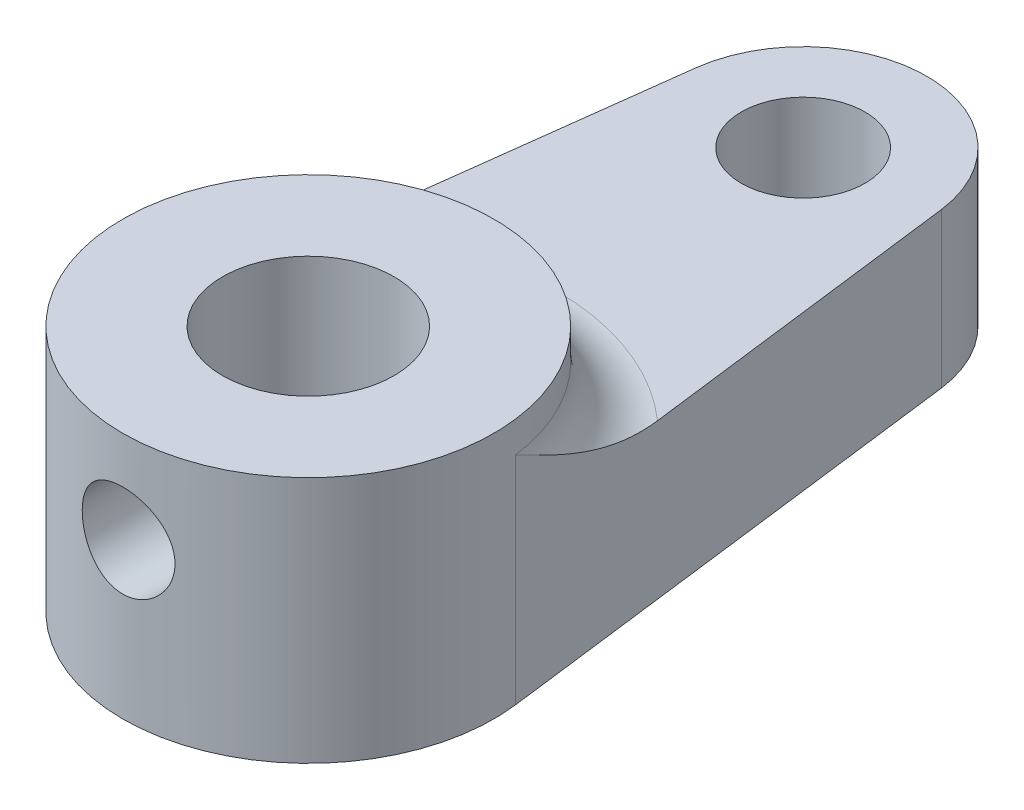
ISO-10303-21;
HEADER;
FILE_DESCRIPTION(('STEP AP214'),'2;1');
FILE_NAME('part.step','',(''),(''),'','','');
FILE_SCHEMA(('AUTOMOTIVE_DESIGN { 1 0 10303 214 1 1 1 1 }'));
ENDSEC;
DATA;
#1=APPLICATION_CONTEXT('core data for automotive mechanical design processes');
#2=APPLICATION_PROTOCOL_DEFINITION('international standard','automotive_design',2000,#1);
#3=PRODUCT_CONTEXT('',#1,'mechanical');
#4=PRODUCT('Part','Part','',(#3));
#5=PRODUCT_RELATED_PRODUCT_CATEGORY('part','',(#4));
#6=PRODUCT_DEFINITION_FORMATION('','',#4);
#7=PRODUCT_DEFINITION_CONTEXT('part definition',#1,'design');
#8=PRODUCT_DEFINITION('design','',#6,#7);
#9=PRODUCT_DEFINITION_SHAPE('','',#8);
#10=(LENGTH_UNIT() NAMED_UNIT(*) SI_UNIT(.MILLI.,.METRE.));
#11=(NAMED_UNIT(*) PLANE_ANGLE_UNIT() SI_UNIT($,.RADIAN.));
#12=(NAMED_UNIT(*) SI_UNIT($,.STERADIAN.) SOLID_ANGLE_UNIT());
#13=UNCERTAINTY_MEASURE_WITH_UNIT(LENGTH_MEASURE(1.E-05),#10,'distance_accuracy_value','');
#14=(GEOMETRIC_REPRESENTATION_CONTEXT(3) GLOBAL_UNCERTAINTY_ASSIGNED_CONTEXT((#13)) GLOBAL_UNIT_ASSIGNED_CONTEXT((#10,
#11,#12)) REPRESENTATION_CONTEXT('',''));
#15=CARTESIAN_POINT('',(0.,0.,0.));
#16=DIRECTION('',(0.,0.,1.));
#17=DIRECTION('',(1.,0.,0.));
#18=AXIS2_PLACEMENT_3D('',#15,#16,#17);
#19=CARTESIAN_POINT('',(0.,2.5,0.));
#20=DIRECTION('',(0.,-1.,0.));
#21=DIRECTION('',(0.,0.,-1.));
#22=AXIS2_PLACEMENT_3D('',#19,#20,#21);
#23=CYLINDRICAL_SURFACE('',#22,6.);
#24=CARTESIAN_POINT('',(0.,4.5,0.));
#25=DIRECTION('',(0.,1.,0.));
#26=DIRECTION('',(0.,0.,1.));
#27=AXIS2_PLACEMENT_3D('',#24,#25,#26);
#28=CIRCLE('',#27,6.);
#29=CARTESIAN_POINT('',(5.95294044989533,4.5,-0.75));
#30=VERTEX_POINT('',#29);
#31=CARTESIAN_POINT('',(-5.95294044989533,4.5,-0.75));
#32=VERTEX_POINT('',#31);
#33=EDGE_CURVE('E125',#30,#32,#28,.T.);
#34=ORIENTED_EDGE('',*,*,#33,.T.);
#35=DIRECTION('',(0.,-1.,0.));
#36=VECTOR('',#35,1.);
#37=CARTESIAN_POINT('',(-5.95294044989533,2.5,-0.75));
#38=LINE('',#37,#36);
#39=CARTESIAN_POINT('',(-5.95294044989533,-2.5,-0.75));
#40=VERTEX_POINT('',#39);
#41=EDGE_CURVE('E109',#32,#40,#38,.T.);
#42=ORIENTED_EDGE('',*,*,#41,.T.);
#43=CARTESIAN_POINT('',(0.,-2.5,0.));
#44=DIRECTION('',(0.,1.,0.));
#45=DIRECTION('',(0.,0.,1.));
#46=AXIS2_PLACEMENT_3D('',#43,#44,#45);
#47=CIRCLE('',#46,6.);
#48=CARTESIAN_POINT('',(5.95294044989533,-2.5,-0.75));
#49=VERTEX_POINT('',#48);
#50=EDGE_CURVE('E113',#40,#49,#47,.T.);
#51=ORIENTED_EDGE('',*,*,#50,.T.);
#52=DIRECTION('',(0.,-1.,0.));
#53=VECTOR('',#52,1.);
#54=CARTESIAN_POINT('',(5.95294044989533,2.5,-0.75));
#55=LINE('',#54,#53);
#56=EDGE_CURVE('E102',#30,#49,#55,.T.);
#57=ORIENTED_EDGE('',*,*,#56,.F.);
#58=EDGE_LOOP('',(#34,#42,#51,#57));
#59=FACE_BOUND('',#58,.T.);
#60=CARTESIAN_POINT('',(0.,5.5,0.));
#61=DIRECTION('',(0.,1.,0.));
#62=DIRECTION('',(0.,0.,1.));
#63=AXIS2_PLACEMENT_3D('',#60,#61,#62);
#64=CIRCLE('',#63,6.);
#65=CARTESIAN_POINT('',(0.,5.5,6.));
#66=VERTEX_POINT('',#65);
#67=EDGE_CURVE('E196',#66,#66,#64,.T.);
#68=ORIENTED_EDGE('',*,*,#67,.F.);
#69=EDGE_LOOP('',(#68));
#70=FACE_BOUND('',#69,.T.);
#71=CARTESIAN_POINT('',(-1.5,2.5,5.80947501931112));
#72=CARTESIAN_POINT('',(-1.49999764715507,2.41716954944523,5.80947660051185));
#73=CARTESIAN_POINT('',(-1.49311574729838,2.3343130607932,5.81126583608348));
#74=CARTESIAN_POINT('',(-1.46581387527848,2.17097945309558,5.81821117195949));
#75=CARTESIAN_POINT('',(-1.44538602404532,2.090503747319,5.82336923173088));
#76=CARTESIAN_POINT('',(-1.39169471977917,1.93431787708777,5.8364323475758));
#77=CARTESIAN_POINT('',(-1.35844783671268,1.8586017067686,5.84433385614245));
#78=CARTESIAN_POINT('',(-1.28011268475685,1.71381348847605,5.86198915217285));
#79=CARTESIAN_POINT('',(-1.23502391313642,1.64474172275186,5.87174301827101));
#80=CARTESIAN_POINT('',(-1.13322505638712,1.51368301284268,5.89224429813367));
#81=CARTESIAN_POINT('',(-1.07630213262243,1.45186383978997,5.90300758573818));
#82=CARTESIAN_POINT('',(-0.952909238460399,1.33854316338379,5.92417725309178));
#83=CARTESIAN_POINT('',(-0.886438376508184,1.28704262462695,5.93458359939833));
#84=CARTESIAN_POINT('',(-0.744687120647373,1.19513471942123,5.95404249312349));
#85=CARTESIAN_POINT('',(-0.669296745717072,1.15489216710312,5.96307412440355));
#86=CARTESIAN_POINT('',(-0.512557910575657,1.08771421350815,5.9785848715559));
#87=CARTESIAN_POINT('',(-0.431210331475164,1.06077684885069,5.98506436400606));
#88=CARTESIAN_POINT('',(-0.266615255252497,1.02151129925285,5.99462855308908));
#89=CARTESIAN_POINT('',(-0.183439631729385,1.00889821340405,5.99777936306588));
#90=CARTESIAN_POINT('',(-0.0160972915576614,0.997744972434667,6.00056156464378));
#91=CARTESIAN_POINT('',(0.0680692767228413,0.99920273667424,6.00019347658022));
#92=CARTESIAN_POINT('',(0.233028370758581,1.01594491015009,5.9960285697212));
#93=CARTESIAN_POINT('',(0.313854323401601,1.03092179503231,5.99230801404524));
#94=CARTESIAN_POINT('',(0.47180737112053,1.0737827620291,5.98194501914912));
#95=CARTESIAN_POINT('',(0.548934269055657,1.10166753122645,5.97530242439064));
#96=CARTESIAN_POINT('',(0.69811005525271,1.16980154241224,5.95972505820537));
#97=CARTESIAN_POINT('',(0.770106764649757,1.21016022679705,5.95077011817032));
#98=CARTESIAN_POINT('',(0.906413433510733,1.30201340746975,5.93153942285789));
#99=CARTESIAN_POINT('',(0.970722052628258,1.35350984113637,5.92126343791494));
#100=CARTESIAN_POINT('',(1.09166105262743,1.46782524518943,5.90018228261712));
#101=CARTESIAN_POINT('',(1.1480365186128,1.53091293540866,5.8893703171555));
#102=CARTESIAN_POINT('',(1.24946456394453,1.66575998412415,5.86869026110024));
#103=CARTESIAN_POINT('',(1.29451661406902,1.7375197476946,5.85882221463582));
#104=CARTESIAN_POINT('',(1.3721821935339,1.88817402048938,5.84112298098989));
#105=CARTESIAN_POINT('',(1.40473435045574,1.96710143818792,5.83330190235432));
#106=CARTESIAN_POINT('',(1.45602843095451,2.12955128084587,5.82071184083974));
#107=CARTESIAN_POINT('',(1.47477330982936,2.21307271838988,5.81594220486131));
#108=CARTESIAN_POINT('',(1.49749778319911,2.37997570091387,5.81013213623484));
#109=CARTESIAN_POINT('',(1.50185428435178,2.46330267599778,5.80899653456189));
#110=CARTESIAN_POINT('',(1.49671019430933,2.6294931619469,5.81032406088623));
#111=CARTESIAN_POINT('',(1.48721087870928,2.71235671477074,5.81278685760759));
#112=CARTESIAN_POINT('',(1.4549552783626,2.87386855897282,5.82094249172736));
#113=CARTESIAN_POINT('',(1.43241844096905,2.95256363594251,5.82658182140625));
#114=CARTESIAN_POINT('',(1.37497084900237,3.10505887471101,5.84040430962577));
#115=CARTESIAN_POINT('',(1.34005862862753,3.1788584554332,5.84858776949168));
#116=CARTESIAN_POINT('',(1.25806240076193,3.32106476672041,5.86677682255957));
#117=CARTESIAN_POINT('',(1.21075305230138,3.38933730402586,5.87681501163985));
#118=CARTESIAN_POINT('',(1.10559043940168,3.51711301768081,5.89750249843029));
#119=CARTESIAN_POINT('',(1.04773544220816,3.57661474999004,5.90815189637082));
#120=CARTESIAN_POINT('',(0.921394081477088,3.68668662554257,5.92918441818964));
#121=CARTESIAN_POINT('',(0.852677928797388,3.73699603752929,5.93955421237101));
#122=CARTESIAN_POINT('',(0.707554024042012,3.82536152017075,5.9585832996824));
#123=CARTESIAN_POINT('',(0.631146673436386,3.86341822996492,5.96724268202376));
#124=CARTESIAN_POINT('',(0.473337302596635,3.92586762071676,5.98182069442988));
#125=CARTESIAN_POINT('',(0.391976071541821,3.95035857062744,5.98775898013446));
#126=CARTESIAN_POINT('',(0.226124640478211,3.98527620076505,5.99631176037473));
#127=CARTESIAN_POINT('',(0.141635047561865,3.99570559524343,5.99892689636045));
#128=CARTESIAN_POINT('',(-0.0256252896649894,4.0020513843633,6.00051254113216));
#129=CARTESIAN_POINT('',(-0.10838074044905,3.99835256364309,5.99957968320012));
#130=CARTESIAN_POINT('',(-0.272051244622109,3.9774282590585,5.99438844686135));
#131=CARTESIAN_POINT('',(-0.35296635267133,3.96020317748035,5.99013016735642));
#132=CARTESIAN_POINT('',(-0.510256553467224,3.91292167034361,5.97878149280944));
#133=CARTESIAN_POINT('',(-0.586653741871528,3.88293482002806,5.97170646753999));
#134=CARTESIAN_POINT('',(-0.733375579562203,3.81104413147101,5.95546933370076));
#135=CARTESIAN_POINT('',(-0.803699461897577,3.76913879099565,5.94630696206604));
#136=CARTESIAN_POINT('',(-0.938102892635849,3.67342714900439,5.92660874521999));
#137=CARTESIAN_POINT('',(-1.00199248245088,3.61935978563893,5.91604525418417));
#138=CARTESIAN_POINT('',(-1.11992253040688,3.5013657220393,5.89485973579863));
#139=CARTESIAN_POINT('',(-1.17396048760228,3.43743652585314,5.88423769428833));
#140=CARTESIAN_POINT('',(-1.27164303971884,3.300097878698,5.86391213790822));
#141=CARTESIAN_POINT('',(-1.31507492916982,3.22653381488106,5.85422945594827));
#142=CARTESIAN_POINT('',(-1.3888903449235,3.07291676511595,5.83715933325923));
#143=CARTESIAN_POINT('',(-1.41928336463958,2.99286855083989,5.82977022370054));
#144=CARTESIAN_POINT('',(-1.46163379284816,2.84413448225993,5.81927863109675));
#145=CARTESIAN_POINT('',(-1.47598975589307,2.77616025342421,5.8156299450082));
#146=CARTESIAN_POINT('',(-1.4951734388599,2.63879669650005,5.81072757878358));
#147=CARTESIAN_POINT('',(-1.50000197155828,2.56940748963241,5.80947369434944));
#148=CARTESIAN_POINT('',(-1.5,2.5,5.80947501931112));
#149=B_SPLINE_CURVE_WITH_KNOTS('',3,(#71,#72,#73,#74,#75,#76,#77,#78,#79,#80,#81,#82,#83,#84,
#85,#86,#87,#88,#89,#90,#91,#92,#93,#94,#95,#96,#97,#98,#99,#100,#101,#102,#103,#104,#105,#106,
#107,#108,#109,#110,#111,#112,#113,#114,#115,#116,#117,#118,#119,#120,#121,#122,#123,#124,#125,
#126,#127,#128,#129,#130,#131,#132,#133,#134,#135,#136,#137,#138,#139,#140,#141,#142,#143,#144,
#145,#146,#147,#148),.UNSPECIFIED.,.T.,.F.,(4,2,2,2,2,2,2,2,2,2,2,2,2,2,2,2,2,2,2,2,2,2,2,2,2,2,
2,2,2,2,2,2,2,2,2,2,2,2,4),(0.,0.248236465041682,0.4966174448572,0.744678436299613,
0.992749960532872,1.24574372515786,1.4987611288792,1.75530897838752,2.01181895908255,
2.26313250597208,2.51440889199612,2.76010957613368,3.00582334034872,3.25375724552667,
3.50173431281348,3.75642279943147,4.01112318719881,4.26705859205041,4.52293920077729,
4.7720614485703,5.02116076310281,5.26618443005524,5.51123712852851,5.76109707515494,
6.01099811331027,6.26715198579191,6.52329249431732,6.77755243684158,7.03176329345423,
7.27910067676474,7.52643070426189,7.77242925935827,8.01845883442843,8.27038257949243,
8.52237018939305,8.77905886370806,9.03556032819972,9.24358696306398,9.45159585059713),.UNSPECIFIED.);
#150=CARTESIAN_POINT('',(-1.5,2.5,5.80947501931112));
#151=VERTEX_POINT('',#150);
#152=EDGE_CURVE('E155',#151,#151,#149,.T.);
#153=ORIENTED_EDGE('',*,*,#152,.F.);
#154=EDGE_LOOP('',(#153));
#155=FACE_BOUND('',#154,.T.);
#156=ADVANCED_FACE('F33',(#59,#70,#155),#23,.T.);
#157=CARTESIAN_POINT('',(0.,2.5,0.));
#158=DIRECTION('',(0.,-1.,0.));
#159=DIRECTION('',(0.,0.,-1.));
#160=AXIS2_PLACEMENT_3D('',#157,#158,#159);
#161=CYLINDRICAL_SURFACE('',#160,2.77361799511822);
#162=CARTESIAN_POINT('',(0.,5.5,0.));
#163=DIRECTION('',(0.,1.,0.));
#164=DIRECTION('',(0.,0.,1.));
#165=AXIS2_PLACEMENT_3D('',#162,#163,#164);
#166=CIRCLE('',#165,2.77361799511822);
#167=CARTESIAN_POINT('',(0.,5.5,2.77361799511822));
#168=VERTEX_POINT('',#167);
#169=EDGE_CURVE('E161',#168,#168,#166,.T.);
#170=ORIENTED_EDGE('',*,*,#169,.T.);
#171=EDGE_LOOP('',(#170));
#172=FACE_BOUND('',#171,.T.);
#173=CARTESIAN_POINT('',(0.,-2.5,0.));
#174=DIRECTION('',(0.,1.,0.));
#175=DIRECTION('',(0.,0.,1.));
#176=AXIS2_PLACEMENT_3D('',#173,#174,#175);
#177=CIRCLE('',#176,2.77361799511822);
#178=CARTESIAN_POINT('',(0.,-2.5,2.77361799511822));
#179=VERTEX_POINT('',#178);
#180=EDGE_CURVE('E116',#179,#179,#177,.T.);
#181=ORIENTED_EDGE('',*,*,#180,.F.);
#182=EDGE_LOOP('',(#181));
#183=FACE_BOUND('',#182,.T.);
#184=CARTESIAN_POINT('',(-1.5,2.5,2.33301452692511));
#185=CARTESIAN_POINT('',(-1.49999411455811,2.42287776045943,2.33302256486452));
#186=CARTESIAN_POINT('',(-1.4940111142054,2.34568212582982,2.33689875914027));
#187=CARTESIAN_POINT('',(-1.4704234853793,2.19374477253578,2.35180624200229));
#188=CARTESIAN_POINT('',(-1.45279842150383,2.11900761185399,2.36285011146732));
#189=CARTESIAN_POINT('',(-1.40696458127593,1.97448494786563,2.39042063783593));
#190=CARTESIAN_POINT('',(-1.37881986063465,1.90467245560653,2.40691404260333));
#191=CARTESIAN_POINT('',(-1.31294257835781,1.77078423647456,2.44347172577073));
#192=CARTESIAN_POINT('',(-1.27520825506525,1.70670956659577,2.46353666007509));
#193=CARTESIAN_POINT('',(-1.18692088938202,1.57923912905864,2.50735535346427));
#194=CARTESIAN_POINT('',(-1.13547690251612,1.51651825729556,2.53127803757925));
#195=CARTESIAN_POINT('',(-1.0230729907639,1.40005611114161,2.5787600733585));
#196=CARTESIAN_POINT('',(-0.962107604061448,1.34632002761013,2.60231920790124));
#197=CARTESIAN_POINT('',(-0.826284156836843,1.24500841736537,2.64872953382559));
#198=CARTESIAN_POINT('',(-0.750696019036527,1.19830250185868,2.67136330807933));
#199=CARTESIAN_POINT('',(-0.591279562071904,1.11858334405385,2.7111016198093));
#200=CARTESIAN_POINT('',(-0.507457371242145,1.08556001235702,2.72821022942529));
#201=CARTESIAN_POINT('',(-0.341135136607568,1.03695076318846,2.75373906524502));
#202=CARTESIAN_POINT('',(-0.259077283300809,1.02016974527789,2.76275047587585));
#203=CARTESIAN_POINT('',(-0.0928587733356264,1.00054493256186,2.77331023275396));
#204=CARTESIAN_POINT('',(-0.00869969182819904,0.997690995212976,2.77486401008783));
#205=CARTESIAN_POINT('',(0.150174120724916,1.00563505088632,2.77057379787987));
#206=CARTESIAN_POINT('',(0.224981704310617,1.01507896732805,2.76546348650657));
#207=CARTESIAN_POINT('',(0.371757709190463,1.04486966023716,2.74958222538097));
#208=CARTESIAN_POINT('',(0.44372591330451,1.06521726898335,2.73881084352039));
#209=CARTESIAN_POINT('',(0.583873953835369,1.11626550772103,2.7124152977333));
#210=CARTESIAN_POINT('',(0.652000878910128,1.14708219276354,2.69673689748021));
#211=CARTESIAN_POINT('',(0.78225648463954,1.21797837361199,2.66187607147506));
#212=CARTESIAN_POINT('',(0.844383183287603,1.25806091539774,2.6426924938961));
#213=CARTESIAN_POINT('',(0.967882970047076,1.35117527614546,2.60016560774811));
#214=CARTESIAN_POINT('',(1.0284849140485,1.4051271645501,2.5765969643442));
#215=CARTESIAN_POINT('',(1.14023027094102,1.52203071379441,2.52913526511791));
#216=CARTESIAN_POINT('',(1.19136430092623,1.58499119398688,2.50524191239982));
#217=CARTESIAN_POINT('',(1.28694636244151,1.72444049795002,2.4576021728411));
#218=CARTESIAN_POINT('',(1.330486719172,1.80161853565226,2.43403271413286));
#219=CARTESIAN_POINT('',(1.40366427703862,1.96370807573908,2.39258571223397));
#220=CARTESIAN_POINT('',(1.43331741706679,2.04861057807493,2.37470165130678));
#221=CARTESIAN_POINT('',(1.47531922451647,2.21661906131754,2.34882061223711));
#222=CARTESIAN_POINT('',(1.48887623961101,2.2993123282295,2.34013942456715));
#223=CARTESIAN_POINT('',(1.50194714168871,2.46621904332178,2.33177694969722));
#224=CARTESIAN_POINT('',(1.50147568410419,2.55043081319326,2.33208627017804));
#225=CARTESIAN_POINT('',(1.48761025358577,2.70548626244963,2.34094268443109));
#226=CARTESIAN_POINT('',(1.47601164635423,2.7765686745675,2.34834511070335));
#227=CARTESIAN_POINT('',(1.44304866791695,2.91559234950911,2.36874233957416));
#228=CARTESIAN_POINT('',(1.4216802749365,2.98353230603195,2.38173944511766));
#229=CARTESIAN_POINT('',(1.36886790434253,3.11776268821236,2.41249345778993));
#230=CARTESIAN_POINT('',(1.33702664844045,3.1838533288192,2.43043256839994));
#231=CARTESIAN_POINT('',(1.2645032057971,3.31014882084098,2.46894183543394));
#232=CARTESIAN_POINT('',(1.22381656758352,3.37035068650869,2.48951331445503));
#233=CARTESIAN_POINT('',(1.12755227469864,3.4927610463265,2.53472262563768));
#234=CARTESIAN_POINT('',(1.07065077288925,3.55388081297149,2.55950287960289));
#235=CARTESIAN_POINT('',(0.947166176799606,3.66612251128696,2.60772480048465));
#236=CARTESIAN_POINT('',(0.880577927759388,3.71723908562284,2.63116574538539));
#237=CARTESIAN_POINT('',(0.735682748450293,3.81015392183646,2.67539049414694));
#238=CARTESIAN_POINT('',(0.65698058725606,3.85142265958239,2.69600496657148));
#239=CARTESIAN_POINT('',(0.49231989083002,3.91969777284431,2.73086665480519));
#240=CARTESIAN_POINT('',(0.406368804791623,3.94671858767252,2.74512031460963));
#241=CARTESIAN_POINT('',(0.238934201200675,3.98307066097138,2.76446123499505));
#242=CARTESIAN_POINT('',(0.157866677042771,3.99390378787246,2.77032420328927));
#243=CARTESIAN_POINT('',(-0.00513570252384716,4.00220589943771,2.77480883325488));
#244=CARTESIAN_POINT('',(-0.087070114413215,3.99968141670986,2.77343403459523));
#245=CARTESIAN_POINT('',(-0.242105156506488,3.98221220633394,2.76403066683394));
#246=CARTESIAN_POINT('',(-0.315365854922256,3.96833847003654,2.75657600978777));
#247=CARTESIAN_POINT('',(-0.458351906863273,3.93017163442464,2.73643663877369));
#248=CARTESIAN_POINT('',(-0.52807682346568,3.90587725090367,2.72375128019869));
#249=CARTESIAN_POINT('',(-0.66490276037586,3.84672278947882,2.69368661403883));
#250=CARTESIAN_POINT('',(-0.73181733244322,3.81151196317309,2.6761539632025));
#251=CARTESIAN_POINT('',(-0.859021564350853,3.73195645801237,2.63807775390285));
#252=CARTESIAN_POINT('',(-0.919308425660679,3.68760794334063,2.61753293203908));
#253=CARTESIAN_POINT('',(-1.03873619030953,3.58530463124816,2.57264375806816));
#254=CARTESIAN_POINT('',(-1.09698524699134,3.52638043244154,2.54813197477942));
#255=CARTESIAN_POINT('',(-1.20319323440435,3.3995424539712,2.49973946786568));
#256=CARTESIAN_POINT('',(-1.25114027024761,3.33161842762986,2.4758595013348));
#257=CARTESIAN_POINT('',(-1.33805677865394,3.18366481802919,2.4300444813687));
#258=CARTESIAN_POINT('',(-1.37632331563278,3.1031556893388,2.40830937385864));
#259=CARTESIAN_POINT('',(-1.43820250943229,2.93532623673363,2.37188636786227));
#260=CARTESIAN_POINT('',(-1.46186262045998,2.84802901838722,2.35717568368523));
#261=CARTESIAN_POINT('',(-1.48495158508717,2.71632681831888,2.34263590287291));
#262=CARTESIAN_POINT('',(-1.490581915327,2.6733430529118,2.33904728266271));
#263=CARTESIAN_POINT('',(-1.49810781140543,2.58691396871142,2.33423431046878));
#264=CARTESIAN_POINT('',(-1.50000331722952,2.54346864251263,2.33300999647687));
#265=CARTESIAN_POINT('',(-1.5,2.5,2.33301452692511));
#266=B_SPLINE_CURVE_WITH_KNOTS('',3,(#184,#185,#186,#187,#188,#189,#190,#191,#192,#193,#194,
#195,#196,#197,#198,#199,#200,#201,#202,#203,#204,#205,#206,#207,#208,#209,#210,#211,#212,#213,
#214,#215,#216,#217,#218,#219,#220,#221,#222,#223,#224,#225,#226,#227,#228,#229,#230,#231,#232,
#233,#234,#235,#236,#237,#238,#239,#240,#241,#242,#243,#244,#245,#246,#247,#248,#249,#250,#251,
#252,#253,#254,#255,#256,#257,#258,#259,#260,#261,#262,#263,#264,#265),.UNSPECIFIED.,.T.,.F.,(4,
2,2,2,2,2,2,2,2,2,2,2,2,2,2,2,2,2,2,2,2,2,2,2,2,2,2,2,2,2,2,2,2,2,2,2,2,2,2,2,4),(0.,
0.231182597982045,0.462772074736279,0.692973753758703,0.923217752565692,1.17590342841347,
1.42873458985326,1.70235061943506,1.97576452669968,2.22704692521403,2.47814629733154,
2.70380119300509,2.92947331537013,3.15773350543185,3.3860688388022,3.63849606181909,
3.89117212213354,4.16482819740932,4.4381694126604,4.68934287688105,4.94025395142995,
5.15648008849858,5.37279531624846,5.59850511330702,5.82432876371224,6.08451681956529,
6.34484384330051,6.61701046934401,6.8889007400979,7.1335328749861,7.3780453823265,
7.60183082371816,7.82564385162263,8.05756162025673,8.28957694235183,8.54769273895913,
8.8061049777141,9.07987560075996,9.35275203546166,9.483052092762,9.61335424382357),.UNSPECIFIED.);
#267=CARTESIAN_POINT('',(-1.5,2.5,2.33301452692511));
#268=VERTEX_POINT('',#267);
#269=EDGE_CURVE('E38',#268,#268,#266,.T.);
#270=ORIENTED_EDGE('',*,*,#269,.T.);
#271=EDGE_LOOP('',(#270));
#272=FACE_BOUND('',#271,.T.);
#273=ADVANCED_FACE('F152',(#172,#183,#272),#161,.F.);
#274=CARTESIAN_POINT('',(0.,2.5,0.));
#275=DIRECTION('',(0.,1.,0.));
#276=DIRECTION('',(0.,0.,1.));
#277=AXIS2_PLACEMENT_3D('',#274,#275,#276);
#278=PLANE('',#277);
#279=DIRECTION('',(-0.125,0.,0.992156741649221));
#280=VECTOR('',#279,1.);
#281=CARTESIAN_POINT('',(-5.95294044989533,2.5,-0.75));
#282=LINE('',#281,#280);
#283=CARTESIAN_POINT('',(-3.96862696659688,2.5,-16.5));
#284=VERTEX_POINT('',#283);
#285=CARTESIAN_POINT('',(-5.29150262212918,2.5,-6.));
#286=VERTEX_POINT('',#285);
#287=EDGE_CURVE('E107',#284,#286,#282,.T.);
#288=ORIENTED_EDGE('',*,*,#287,.T.);
#289=CARTESIAN_POINT('',(0.,2.5,0.));
#290=DIRECTION('',(0.,1.,0.));
#291=DIRECTION('',(0.,0.,1.));
#292=AXIS2_PLACEMENT_3D('',#289,#290,#291);
#293=CIRCLE('',#292,8.);
#294=CARTESIAN_POINT('',(5.29150262212918,2.5,-6.));
#295=VERTEX_POINT('',#294);
#296=EDGE_CURVE('E61',#286,#295,#293,.F.);
#297=ORIENTED_EDGE('',*,*,#296,.T.);
#298=DIRECTION('',(-0.125,0.,-0.992156741649221));
#299=VECTOR('',#298,1.);
#300=CARTESIAN_POINT('',(5.95294044989533,2.5,-0.75));
#301=LINE('',#300,#299);
#302=CARTESIAN_POINT('',(3.96862696659688,2.5,-16.5));
#303=VERTEX_POINT('',#302);
#304=EDGE_CURVE('E84',#295,#303,#301,.T.);
#305=ORIENTED_EDGE('',*,*,#304,.T.);
#306=CARTESIAN_POINT('',(0.,2.5,-16.));
#307=DIRECTION('',(0.,1.,0.));
#308=DIRECTION('',(0.,0.,1.));
#309=AXIS2_PLACEMENT_3D('',#306,#307,#308);
#310=CIRCLE('',#309,4.);
#311=EDGE_CURVE('E89',#303,#284,#310,.T.);
#312=ORIENTED_EDGE('',*,*,#311,.T.);
#313=EDGE_LOOP('',(#288,#297,#305,#312));
#314=FACE_BOUND('',#313,.T.);
#315=CARTESIAN_POINT('',(0.,2.5,-16.));
#316=DIRECTION('',(0.,1.,0.));
#317=DIRECTION('',(0.,0.,1.));
#318=AXIS2_PLACEMENT_3D('',#315,#316,#317);
#319=CIRCLE('',#318,2.);
#320=CARTESIAN_POINT('',(0.,2.5,-14.));
#321=VERTEX_POINT('',#320);
#322=EDGE_CURVE('E195',#321,#321,#319,.T.);
#323=ORIENTED_EDGE('',*,*,#322,.F.);
#324=EDGE_LOOP('',(#323));
#325=FACE_BOUND('',#324,.T.);
#326=ADVANCED_FACE('F86',(#314,#325),#278,.T.);
#327=CARTESIAN_POINT('',(0.,-2.5,0.));
#328=DIRECTION('',(0.,1.,0.));
#329=DIRECTION('',(0.,0.,1.));
#330=AXIS2_PLACEMENT_3D('',#327,#328,#329);
#331=PLANE('',#330);
#332=ORIENTED_EDGE('',*,*,#50,.F.);
#333=DIRECTION('',(-0.125,0.,0.992156741649221));
#334=VECTOR('',#333,1.);
#335=CARTESIAN_POINT('',(-5.95294044989533,-2.5,-0.75));
#336=LINE('',#335,#334);
#337=CARTESIAN_POINT('',(-3.96862696659688,-2.5,-16.5));
#338=VERTEX_POINT('',#337);
#339=EDGE_CURVE('E93',#338,#40,#336,.T.);
#340=ORIENTED_EDGE('',*,*,#339,.F.);
#341=CARTESIAN_POINT('',(0.,-2.5,-16.));
#342=DIRECTION('',(0.,1.,0.));
#343=DIRECTION('',(0.,0.,1.));
#344=AXIS2_PLACEMENT_3D('',#341,#342,#343);
#345=CIRCLE('',#344,4.);
#346=CARTESIAN_POINT('',(3.96862696659688,-2.5,-16.5));
#347=VERTEX_POINT('',#346);
#348=EDGE_CURVE('E118',#347,#338,#345,.T.);
#349=ORIENTED_EDGE('',*,*,#348,.F.);
#350=DIRECTION('',(-0.125,0.,-0.992156741649221));
#351=VECTOR('',#350,1.);
#352=CARTESIAN_POINT('',(5.95294044989533,-2.5,-0.75));
#353=LINE('',#352,#351);
#354=EDGE_CURVE('E99',#49,#347,#353,.T.);
#355=ORIENTED_EDGE('',*,*,#354,.F.);
#356=EDGE_LOOP('',(#332,#340,#349,#355));
#357=FACE_BOUND('',#356,.T.);
#358=ORIENTED_EDGE('',*,*,#180,.T.);
#359=EDGE_LOOP('',(#358));
#360=FACE_BOUND('',#359,.T.);
#361=CARTESIAN_POINT('',(0.,-2.5,-16.));
#362=DIRECTION('',(0.,1.,0.));
#363=DIRECTION('',(0.,0.,1.));
#364=AXIS2_PLACEMENT_3D('',#361,#362,#363);
#365=CIRCLE('',#364,2.);
#366=CARTESIAN_POINT('',(0.,-2.5,-14.));
#367=VERTEX_POINT('',#366);
#368=EDGE_CURVE('E193',#367,#367,#365,.T.);
#369=ORIENTED_EDGE('',*,*,#368,.T.);
#370=EDGE_LOOP('',(#369));
#371=FACE_BOUND('',#370,.T.);
#372=ADVANCED_FACE('F145',(#357,#360,#371),#331,.F.);
#373=CARTESIAN_POINT('',(5.95294044989533,2.5,-0.75));
#374=DIRECTION('',(-0.992156741649222,0.,0.125));
#375=DIRECTION('',(0.125,0.,0.992156741649222));
#376=AXIS2_PLACEMENT_3D('',#373,#374,#375);
#377=PLANE('',#376);
#378=ORIENTED_EDGE('',*,*,#354,.T.);
#379=DIRECTION('',(0.,-1.,0.));
#380=VECTOR('',#379,1.);
#381=CARTESIAN_POINT('',(3.96862696659688,2.5,-16.5));
#382=LINE('',#381,#380);
#383=EDGE_CURVE('E96',#303,#347,#382,.T.);
#384=ORIENTED_EDGE('',*,*,#383,.F.);
#385=ORIENTED_EDGE('',*,*,#304,.F.);
#386=CARTESIAN_POINT('',(5.29150262212918,2.5,-6.));
#387=CARTESIAN_POINT('',(5.31039781985094,2.50003932371851,-5.85002401756451));
#388=CARTESIAN_POINT('',(5.32927068108437,2.50749080861599,-5.70022532550883));
#389=CARTESIAN_POINT('',(5.36682983971642,2.53529748814418,-5.40210874592909));
#390=CARTESIAN_POINT('',(5.3855164496833,2.55562506504836,-5.25378837747146));
#391=CARTESIAN_POINT('',(5.4223769561307,2.60690972129816,-4.96121717769232));
#392=CARTESIAN_POINT('',(5.44055436264514,2.63771036698693,-4.81693848634028));
#393=CARTESIAN_POINT('',(5.4766355591558,2.70848018103579,-4.53055286742176));
#394=CARTESIAN_POINT('',(5.49453918362407,2.74845467894669,-4.38844725369254));
#395=CARTESIAN_POINT('',(5.55104862359352,2.88804779430894,-3.93991747903239));
#396=CARTESIAN_POINT('',(5.5890905459691,3.0022836971649,-3.6379690810306));
#397=CARTESIAN_POINT('',(5.66384180156044,3.25580816906903,-3.04464938357709));
#398=CARTESIAN_POINT('',(5.70054954085282,3.39512559194528,-2.7532907355));
#399=CARTESIAN_POINT('',(5.80963672037381,3.83812108027526,-1.88743809078599));
#400=CARTESIAN_POINT('',(5.88048240155525,4.16533067272575,-1.32511792917894));
#401=CARTESIAN_POINT('',(5.95182241893327,4.49483605454528,-0.758874095651019));
#402=CARTESIAN_POINT('',(5.95238143594607,4.4974180439652,-0.754437035667439));
#403=CARTESIAN_POINT('',(5.95294044989533,4.5,-0.75));
#404=B_SPLINE_CURVE_WITH_KNOTS('',3,(#386,#387,#388,#389,#390,#391,#392,#393,#394,#395,#396,
#397,#398,#399,#400,#401,#402,#403),.UNSPECIFIED.,.F.,.F.,(4,2,2,2,2,2,2,2,4),(0.,
0.45304798517222,0.905127510164753,1.350731209615,1.79659444088085,2.76988627914212,
3.74430503334877,5.70583133706964,5.72132327058453),.UNSPECIFIED.);
#405=EDGE_CURVE('E11',#295,#30,#404,.T.);
#406=ORIENTED_EDGE('',*,*,#405,.T.);
#407=ORIENTED_EDGE('',*,*,#56,.T.);
#408=EDGE_LOOP('',(#378,#384,#385,#406,#407));
#409=FACE_BOUND('',#408,.T.);
#410=ADVANCED_FACE('F97',(#409),#377,.F.);
#411=CARTESIAN_POINT('',(0.,2.5,-16.));
#412=DIRECTION('',(0.,-1.,0.));
#413=DIRECTION('',(0.,0.,-1.));
#414=AXIS2_PLACEMENT_3D('',#411,#412,#413);
#415=CYLINDRICAL_SURFACE('',#414,4.);
#416=ORIENTED_EDGE('',*,*,#348,.T.);
#417=DIRECTION('',(0.,-1.,0.));
#418=VECTOR('',#417,1.);
#419=CARTESIAN_POINT('',(-3.96862696659688,2.5,-16.5));
#420=LINE('',#419,#418);
#421=EDGE_CURVE('E103',#284,#338,#420,.T.);
#422=ORIENTED_EDGE('',*,*,#421,.F.);
#423=ORIENTED_EDGE('',*,*,#311,.F.);
#424=ORIENTED_EDGE('',*,*,#383,.T.);
#425=EDGE_LOOP('',(#416,#422,#423,#424));
#426=FACE_BOUND('',#425,.T.);
#427=ADVANCED_FACE('F105',(#426),#415,.T.);
#428=CARTESIAN_POINT('',(-5.95294044989533,2.5,-0.75));
#429=DIRECTION('',(0.992156741649222,0.,0.125));
#430=DIRECTION('',(0.125,0.,-0.992156741649222));
#431=AXIS2_PLACEMENT_3D('',#428,#429,#430);
#432=PLANE('',#431);
#433=ORIENTED_EDGE('',*,*,#339,.T.);
#434=ORIENTED_EDGE('',*,*,#41,.F.);
#435=CARTESIAN_POINT('',(-5.29150262212918,2.5,-6.));
#436=CARTESIAN_POINT('',(-5.31039781985094,2.50003932371851,-5.85002401756451));
#437=CARTESIAN_POINT('',(-5.32927068108437,2.50749080861599,-5.70022532550883));
#438=CARTESIAN_POINT('',(-5.36682983971642,2.53529748814418,-5.40210874592909));
#439=CARTESIAN_POINT('',(-5.3855164496833,2.55562506504836,-5.25378837747146));
#440=CARTESIAN_POINT('',(-5.4223769561307,2.60690972129816,-4.96121717769232));
#441=CARTESIAN_POINT('',(-5.44055436264514,2.63771036698693,-4.81693848634028));
#442=CARTESIAN_POINT('',(-5.4766355591558,2.70848018103579,-4.53055286742176));
#443=CARTESIAN_POINT('',(-5.49453918362407,2.74845467894669,-4.38844725369254));
#444=CARTESIAN_POINT('',(-5.55104862359352,2.88804779430894,-3.93991747903239));
#445=CARTESIAN_POINT('',(-5.5890905459691,3.0022836971649,-3.6379690810306));
#446=CARTESIAN_POINT('',(-5.66384180156044,3.25580816906903,-3.04464938357709));
#447=CARTESIAN_POINT('',(-5.70054954085282,3.39512559194528,-2.7532907355));
#448=CARTESIAN_POINT('',(-5.80963672037381,3.83812108027526,-1.88743809078599));
#449=CARTESIAN_POINT('',(-5.88048240155525,4.16533067272575,-1.32511792917894));
#450=CARTESIAN_POINT('',(-5.95182241893327,4.49483605454528,-0.758874095651019));
#451=CARTESIAN_POINT('',(-5.95238143594607,4.4974180439652,-0.754437035667439));
#452=CARTESIAN_POINT('',(-5.95294044989533,4.5,-0.75));
#453=B_SPLINE_CURVE_WITH_KNOTS('',3,(#435,#436,#437,#438,#439,#440,#441,#442,#443,#444,#445,
#446,#447,#448,#449,#450,#451,#452),.UNSPECIFIED.,.F.,.F.,(4,2,2,2,2,2,2,2,4),(0.,
0.45304798517222,0.905127510164753,1.350731209615,1.79659444088085,2.76988627914212,
3.74430503334877,5.70583133706964,5.72132327058453),.UNSPECIFIED.);
#454=EDGE_CURVE('E48',#32,#286,#453,.F.);
#455=ORIENTED_EDGE('',*,*,#454,.T.);
#456=ORIENTED_EDGE('',*,*,#287,.F.);
#457=ORIENTED_EDGE('',*,*,#421,.T.);
#458=EDGE_LOOP('',(#433,#434,#455,#456,#457));
#459=FACE_BOUND('',#458,.T.);
#460=ADVANCED_FACE('F139',(#459),#432,.F.);
#461=CARTESIAN_POINT('',(0.,2.5,-16.));
#462=DIRECTION('',(0.,-1.,0.));
#463=DIRECTION('',(0.,0.,-1.));
#464=AXIS2_PLACEMENT_3D('',#461,#462,#463);
#465=CYLINDRICAL_SURFACE('',#464,2.);
#466=ORIENTED_EDGE('',*,*,#322,.T.);
#467=EDGE_LOOP('',(#466));
#468=FACE_BOUND('',#467,.T.);
#469=ORIENTED_EDGE('',*,*,#368,.F.);
#470=EDGE_LOOP('',(#469));
#471=FACE_BOUND('',#470,.T.);
#472=ADVANCED_FACE('F144',(#468,#471),#465,.F.);
#473=CARTESIAN_POINT('',(0.,5.5,0.));
#474=DIRECTION('',(0.,1.,0.));
#475=DIRECTION('',(0.,0.,1.));
#476=AXIS2_PLACEMENT_3D('',#473,#474,#475);
#477=PLANE('',#476);
#478=ORIENTED_EDGE('',*,*,#67,.T.);
#479=EDGE_LOOP('',(#478));
#480=FACE_BOUND('',#479,.T.);
#481=ORIENTED_EDGE('',*,*,#169,.F.);
#482=EDGE_LOOP('',(#481));
#483=FACE_BOUND('',#482,.T.);
#484=ADVANCED_FACE('F168',(#480,#483),#477,.T.);
#485=CARTESIAN_POINT('',(0.,4.5,0.));
#486=DIRECTION('',(0.,1.,0.));
#487=DIRECTION('',(0.,0.,1.));
#488=AXIS2_PLACEMENT_3D('',#485,#486,#487);
#489=TOROIDAL_SURFACE('',#488,8.,2.);
#490=ORIENTED_EDGE('',*,*,#405,.F.);
#491=ORIENTED_EDGE('',*,*,#296,.F.);
#492=ORIENTED_EDGE('',*,*,#454,.F.);
#493=ORIENTED_EDGE('',*,*,#33,.F.);
#494=EDGE_LOOP('',(#490,#491,#492,#493));
#495=FACE_BOUND('',#494,.T.);
#496=ADVANCED_FACE('F35',(#495),#489,.F.);
#497=CARTESIAN_POINT('',(0.,2.5,19.));
#498=DIRECTION('',(0.,0.,-1.));
#499=DIRECTION('',(-1.,0.,0.));
#500=AXIS2_PLACEMENT_3D('',#497,#498,#499);
#501=CYLINDRICAL_SURFACE('',#500,1.5);
#502=ORIENTED_EDGE('',*,*,#269,.F.);
#503=EDGE_LOOP('',(#502));
#504=FACE_BOUND('',#503,.T.);
#505=ORIENTED_EDGE('',*,*,#152,.T.);
#506=EDGE_LOOP('',(#505));
#507=FACE_BOUND('',#506,.T.);
#508=ADVANCED_FACE('F163',(#504,#507),#501,.F.);
#509=CLOSED_SHELL('',(#156,#273,#326,#372,#410,#427,#460,#472,#484,#496,#508));
#510=MANIFOLD_SOLID_BREP('B2',#509);
#511=ADVANCED_BREP_SHAPE_REPRESENTATION('',(#18,#510),#14);
#512=SHAPE_DEFINITION_REPRESENTATION(#9,#511);
ENDSEC;
END-ISO-10303-21;
